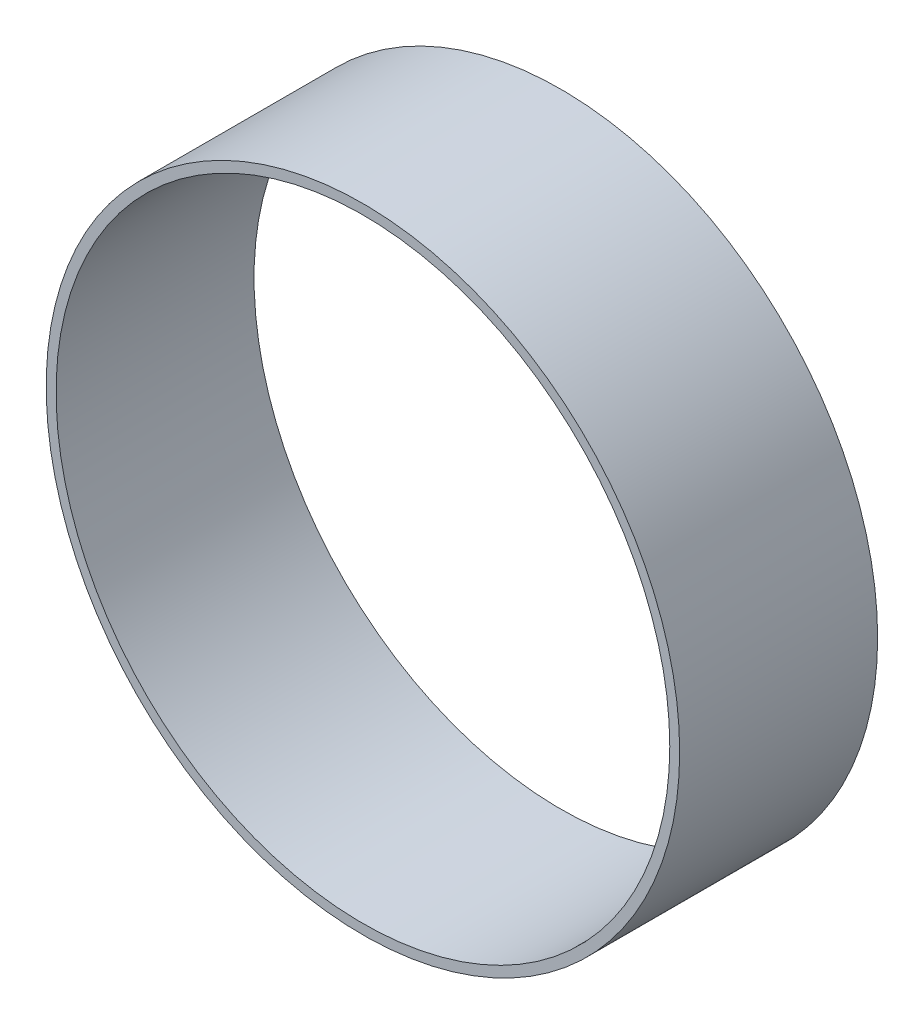
ISO-10303-21;
HEADER;
FILE_DESCRIPTION(('STEP AP214'),'2;1');
FILE_NAME('part.step','',(''),(''),'','','');
FILE_SCHEMA(('AUTOMOTIVE_DESIGN { 1 0 10303 214 1 1 1 1 }'));
ENDSEC;
DATA;
#1=APPLICATION_CONTEXT('core data for automotive mechanical design processes');
#2=APPLICATION_PROTOCOL_DEFINITION('international standard','automotive_design',2000,#1);
#3=PRODUCT_CONTEXT('',#1,'mechanical');
#4=PRODUCT('Part','Part','',(#3));
#5=PRODUCT_RELATED_PRODUCT_CATEGORY('part','',(#4));
#6=PRODUCT_DEFINITION_FORMATION('','',#4);
#7=PRODUCT_DEFINITION_CONTEXT('part definition',#1,'design');
#8=PRODUCT_DEFINITION('design','',#6,#7);
#9=PRODUCT_DEFINITION_SHAPE('','',#8);
#10=(LENGTH_UNIT() NAMED_UNIT(*) SI_UNIT(.MILLI.,.METRE.));
#11=(NAMED_UNIT(*) PLANE_ANGLE_UNIT() SI_UNIT($,.RADIAN.));
#12=(NAMED_UNIT(*) SI_UNIT($,.STERADIAN.) SOLID_ANGLE_UNIT());
#13=UNCERTAINTY_MEASURE_WITH_UNIT(LENGTH_MEASURE(1.E-05),#10,'distance_accuracy_value','');
#14=(GEOMETRIC_REPRESENTATION_CONTEXT(3) GLOBAL_UNCERTAINTY_ASSIGNED_CONTEXT((#13)) GLOBAL_UNIT_ASSIGNED_CONTEXT((#10,
#11,#12)) REPRESENTATION_CONTEXT('',''));
#15=CARTESIAN_POINT('',(0.,0.,0.));
#16=DIRECTION('',(0.,0.,1.));
#17=DIRECTION('',(1.,0.,0.));
#18=AXIS2_PLACEMENT_3D('',#15,#16,#17);
#19=CARTESIAN_POINT('',(0.,0.,50.));
#20=DIRECTION('',(0.,0.,-1.));
#21=DIRECTION('',(-1.,0.,0.));
#22=AXIS2_PLACEMENT_3D('',#19,#20,#21);
#23=CYLINDRICAL_SURFACE('',#22,80.);
#24=CARTESIAN_POINT('',(0.,0.,50.));
#25=DIRECTION('',(0.,0.,1.));
#26=DIRECTION('',(1.,0.,0.));
#27=AXIS2_PLACEMENT_3D('',#24,#25,#26);
#28=CIRCLE('',#27,80.);
#29=CARTESIAN_POINT('',(80.,0.,50.));
#30=VERTEX_POINT('',#29);
#31=EDGE_CURVE('E10',#30,#30,#28,.T.);
#32=ORIENTED_EDGE('',*,*,#31,.F.);
#33=EDGE_LOOP('',(#32));
#34=FACE_BOUND('',#33,.T.);
#35=CARTESIAN_POINT('',(0.,0.,0.));
#36=DIRECTION('',(0.,0.,1.));
#37=DIRECTION('',(1.,0.,0.));
#38=AXIS2_PLACEMENT_3D('',#35,#36,#37);
#39=CIRCLE('',#38,80.);
#40=CARTESIAN_POINT('',(80.,0.,0.));
#41=VERTEX_POINT('',#40);
#42=EDGE_CURVE('E40',#41,#41,#39,.T.);
#43=ORIENTED_EDGE('',*,*,#42,.T.);
#44=EDGE_LOOP('',(#43));
#45=FACE_BOUND('',#44,.T.);
#46=ADVANCED_FACE('F37',(#34,#45),#23,.T.);
#47=CARTESIAN_POINT('',(0.,0.,50.));
#48=DIRECTION('',(0.,0.,1.));
#49=DIRECTION('',(1.,0.,0.));
#50=AXIS2_PLACEMENT_3D('',#47,#48,#49);
#51=PLANE('',#50);
#52=CARTESIAN_POINT('',(0.,0.,50.));
#53=DIRECTION('',(0.,0.,1.));
#54=DIRECTION('',(1.,0.,0.));
#55=AXIS2_PLACEMENT_3D('',#52,#53,#54);
#56=CIRCLE('',#55,77.5);
#57=CARTESIAN_POINT('',(77.5,0.,50.));
#58=VERTEX_POINT('',#57);
#59=EDGE_CURVE('E51',#58,#58,#56,.T.);
#60=ORIENTED_EDGE('',*,*,#59,.F.);
#61=EDGE_LOOP('',(#60));
#62=FACE_BOUND('',#61,.T.);
#63=ORIENTED_EDGE('',*,*,#31,.T.);
#64=EDGE_LOOP('',(#63));
#65=FACE_BOUND('',#64,.T.);
#66=ADVANCED_FACE('F68',(#62,#65),#51,.T.);
#67=CARTESIAN_POINT('',(0.,0.,0.));
#68=DIRECTION('',(0.,0.,1.));
#69=DIRECTION('',(1.,0.,0.));
#70=AXIS2_PLACEMENT_3D('',#67,#68,#69);
#71=PLANE('',#70);
#72=CARTESIAN_POINT('',(0.,0.,0.));
#73=DIRECTION('',(0.,0.,1.));
#74=DIRECTION('',(1.,0.,0.));
#75=AXIS2_PLACEMENT_3D('',#72,#73,#74);
#76=CIRCLE('',#75,77.5);
#77=CARTESIAN_POINT('',(77.5,0.,0.));
#78=VERTEX_POINT('',#77);
#79=EDGE_CURVE('E49',#78,#78,#76,.T.);
#80=ORIENTED_EDGE('',*,*,#79,.T.);
#81=EDGE_LOOP('',(#80));
#82=FACE_BOUND('',#81,.T.);
#83=ORIENTED_EDGE('',*,*,#42,.F.);
#84=EDGE_LOOP('',(#83));
#85=FACE_BOUND('',#84,.T.);
#86=ADVANCED_FACE('F59',(#82,#85),#71,.F.);
#87=CARTESIAN_POINT('',(0.,0.,0.));
#88=DIRECTION('',(0.,0.,1.));
#89=DIRECTION('',(1.,0.,0.));
#90=AXIS2_PLACEMENT_3D('',#87,#88,#89);
#91=CYLINDRICAL_SURFACE('',#90,77.5);
#92=ORIENTED_EDGE('',*,*,#79,.F.);
#93=EDGE_LOOP('',(#92));
#94=FACE_BOUND('',#93,.T.);
#95=ORIENTED_EDGE('',*,*,#59,.T.);
#96=EDGE_LOOP('',(#95));
#97=FACE_BOUND('',#96,.T.);
#98=ADVANCED_FACE('F62',(#94,#97),#91,.F.);
#99=CLOSED_SHELL('',(#46,#66,#86,#98));
#100=MANIFOLD_SOLID_BREP('B2',#99);
#101=ADVANCED_BREP_SHAPE_REPRESENTATION('',(#18,#100),#14);
#102=SHAPE_DEFINITION_REPRESENTATION(#9,#101);
ENDSEC;
END-ISO-10303-21;
